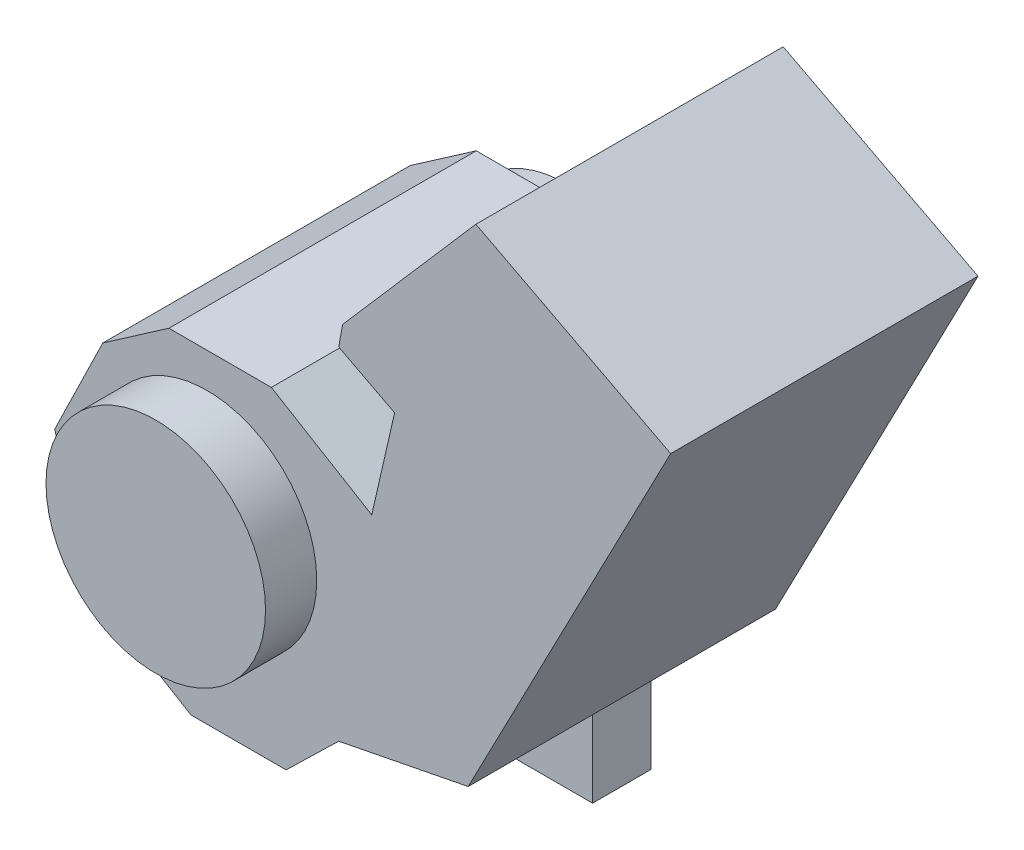
ISO-10303-21;
HEADER;
FILE_DESCRIPTION(('STEP AP214'),'2;1');
FILE_NAME('part.step','',(''),(''),'','','');
FILE_SCHEMA(('AUTOMOTIVE_DESIGN { 1 0 10303 214 1 1 1 1 }'));
ENDSEC;
DATA;
#1=APPLICATION_CONTEXT('core data for automotive mechanical design processes');
#2=APPLICATION_PROTOCOL_DEFINITION('international standard','automotive_design',2000,#1);
#3=PRODUCT_CONTEXT('',#1,'mechanical');
#4=PRODUCT('Part','Part','',(#3));
#5=PRODUCT_RELATED_PRODUCT_CATEGORY('part','',(#4));
#6=PRODUCT_DEFINITION_FORMATION('','',#4);
#7=PRODUCT_DEFINITION_CONTEXT('part definition',#1,'design');
#8=PRODUCT_DEFINITION('design','',#6,#7);
#9=PRODUCT_DEFINITION_SHAPE('','',#8);
#10=(LENGTH_UNIT() NAMED_UNIT(*) SI_UNIT(.MILLI.,.METRE.));
#11=(NAMED_UNIT(*) PLANE_ANGLE_UNIT() SI_UNIT($,.RADIAN.));
#12=(NAMED_UNIT(*) SI_UNIT($,.STERADIAN.) SOLID_ANGLE_UNIT());
#13=UNCERTAINTY_MEASURE_WITH_UNIT(LENGTH_MEASURE(1.E-05),#10,'distance_accuracy_value','');
#14=(GEOMETRIC_REPRESENTATION_CONTEXT(3) GLOBAL_UNCERTAINTY_ASSIGNED_CONTEXT((#13)) GLOBAL_UNIT_ASSIGNED_CONTEXT((#10,
#11,#12)) REPRESENTATION_CONTEXT('',''));
#15=CARTESIAN_POINT('',(0.,0.,0.));
#16=DIRECTION('',(0.,0.,1.));
#17=DIRECTION('',(1.,0.,0.));
#18=AXIS2_PLACEMENT_3D('',#15,#16,#17);
#19=CARTESIAN_POINT('',(-2.85466770870251,14.4994895672538,-105.));
#20=DIRECTION('',(0.193172291046634,-0.981164851577855,0.));
#21=DIRECTION('',(0.981164851577855,0.193172291046634,0.));
#22=AXIS2_PLACEMENT_3D('',#19,#20,#21);
#23=PLANE('',#22);
#24=DIRECTION('',(0.,0.,1.));
#25=VECTOR('',#24,1.);
#26=CARTESIAN_POINT('',(189.435353131504,52.3576576532518,-105.));
#27=LINE('',#26,#25);
#28=CARTESIAN_POINT('',(189.435353131504,52.3576576532518,-105.));
#29=VERTEX_POINT('',#28);
#30=CARTESIAN_POINT('',(189.435353131504,52.3576576532518,-20.));
#31=VERTEX_POINT('',#30);
#32=EDGE_CURVE('E309',#29,#31,#27,.T.);
#33=ORIENTED_EDGE('',*,*,#32,.T.);
#34=DIRECTION('',(0.981164851577855,0.193172291046634,0.));
#35=VECTOR('',#34,1.);
#36=CARTESIAN_POINT('',(-2.85466770870251,14.4994895672538,-20.));
#37=LINE('',#36,#35);
#38=CARTESIAN_POINT('',(100.96354126831,34.9392772830456,-20.));
#39=VERTEX_POINT('',#38);
#40=EDGE_CURVE('E202',#39,#31,#37,.T.);
#41=ORIENTED_EDGE('',*,*,#40,.F.);
#42=DIRECTION('',(0.,0.,1.));
#43=VECTOR('',#42,1.);
#44=CARTESIAN_POINT('',(100.96354126831,34.9392772830456,-105.));
#45=LINE('',#44,#43);
#46=CARTESIAN_POINT('',(100.96354126831,34.9392772830456,-105.));
#47=VERTEX_POINT('',#46);
#48=EDGE_CURVE('E313',#47,#39,#45,.T.);
#49=ORIENTED_EDGE('',*,*,#48,.F.);
#50=DIRECTION('',(0.981164851577855,0.193172291046634,0.));
#51=VECTOR('',#50,1.);
#52=CARTESIAN_POINT('',(-2.85466770870251,14.4994895672538,-105.));
#53=LINE('',#52,#51);
#54=EDGE_CURVE('E269',#47,#29,#53,.T.);
#55=ORIENTED_EDGE('',*,*,#54,.T.);
#56=EDGE_LOOP('',(#33,#41,#49,#55));
#57=FACE_BOUND('',#56,.T.);
#58=ADVANCED_FACE('F35',(#57),#23,.T.);
#59=CARTESIAN_POINT('',(31.5612042021977,-32.4864381311653,-105.));
#60=DIRECTION('',(0.696819192994939,-0.71724682799848,0.));
#61=DIRECTION('',(0.71724682799848,0.696819192994939,0.));
#62=AXIS2_PLACEMENT_3D('',#59,#60,#61);
#63=PLANE('',#62);
#64=ORIENTED_EDGE('',*,*,#48,.T.);
#65=DIRECTION('',(0.71724682799848,0.696819192994939,0.));
#66=VECTOR('',#65,1.);
#67=CARTESIAN_POINT('',(31.5612042021977,-32.4864381311653,-20.));
#68=LINE('',#67,#66);
#69=CARTESIAN_POINT('',(65.,0.,-20.));
#70=VERTEX_POINT('',#69);
#71=EDGE_CURVE('E180',#70,#39,#68,.T.);
#72=ORIENTED_EDGE('',*,*,#71,.F.);
#73=DIRECTION('',(0.,0.,1.));
#74=VECTOR('',#73,1.);
#75=CARTESIAN_POINT('',(65.,0.,-105.));
#76=LINE('',#75,#74);
#77=CARTESIAN_POINT('',(65.,0.,-105.));
#78=VERTEX_POINT('',#77);
#79=EDGE_CURVE('E317',#78,#70,#76,.T.);
#80=ORIENTED_EDGE('',*,*,#79,.F.);
#81=DIRECTION('',(0.71724682799848,0.696819192994939,0.));
#82=VECTOR('',#81,1.);
#83=CARTESIAN_POINT('',(31.5612042021977,-32.4864381311653,-105.));
#84=LINE('',#83,#82);
#85=EDGE_CURVE('E266',#78,#47,#84,.T.);
#86=ORIENTED_EDGE('',*,*,#85,.T.);
#87=EDGE_LOOP('',(#64,#72,#80,#86));
#88=FACE_BOUND('',#87,.T.);
#89=ADVANCED_FACE('F370',(#88),#63,.T.);
#90=CARTESIAN_POINT('',(-108.51999738063,156.513949765839,-105.));
#91=DIRECTION('',(0.569792596014067,-0.821788535772768,0.));
#92=DIRECTION('',(0.821788535772768,0.569792596014067,0.));
#93=AXIS2_PLACEMENT_3D('',#90,#91,#92);
#94=PLANE('',#93);
#95=DIRECTION('',(0.,0.,1.));
#96=VECTOR('',#95,1.);
#97=CARTESIAN_POINT('',(-60.2666413594755,189.970737974536,-105.));
#98=LINE('',#97,#96);
#99=CARTESIAN_POINT('',(-60.2666413594755,189.970737974536,-105.));
#100=VERTEX_POINT('',#99);
#101=CARTESIAN_POINT('',(-60.2666413594755,189.970737974536,105.));
#102=VERTEX_POINT('',#101);
#103=EDGE_CURVE('E39',#100,#102,#98,.T.);
#104=ORIENTED_EDGE('',*,*,#103,.T.);
#105=DIRECTION('',(0.821788535772768,0.569792596014067,0.));
#106=VECTOR('',#105,1.);
#107=CARTESIAN_POINT('',(-108.51999738063,156.513949765839,105.));
#108=LINE('',#107,#106);
#109=CARTESIAN_POINT('',(-15.0682718919732,221.30933075531,105.));
#110=VERTEX_POINT('',#109);
#111=EDGE_CURVE('E209',#102,#110,#108,.T.);
#112=ORIENTED_EDGE('',*,*,#111,.T.);
#113=DIRECTION('',(0.,0.,1.));
#114=VECTOR('',#113,1.);
#115=CARTESIAN_POINT('',(-15.0682718919732,221.30933075531,-105.));
#116=LINE('',#115,#114);
#117=CARTESIAN_POINT('',(-15.0682718919732,221.30933075531,-105.));
#118=VERTEX_POINT('',#117);
#119=EDGE_CURVE('E11',#118,#110,#116,.T.);
#120=ORIENTED_EDGE('',*,*,#119,.F.);
#121=DIRECTION('',(0.821788535772768,0.569792596014067,0.));
#122=VECTOR('',#121,1.);
#123=CARTESIAN_POINT('',(-108.51999738063,156.513949765839,-105.));
#124=LINE('',#123,#122);
#125=EDGE_CURVE('E60',#100,#118,#124,.T.);
#126=ORIENTED_EDGE('',*,*,#125,.F.);
#127=EDGE_LOOP('',(#104,#112,#120,#126));
#128=FACE_BOUND('',#127,.T.);
#129=ADVANCED_FACE('F37',(#128),#94,.F.);
#130=CARTESIAN_POINT('',(0.,221.30933075531,-105.));
#131=DIRECTION('',(0.,1.,0.));
#132=DIRECTION('',(0.,0.,1.));
#133=AXIS2_PLACEMENT_3D('',#130,#131,#132);
#134=PLANE('',#133);
#135=ORIENTED_EDGE('',*,*,#119,.T.);
#136=DIRECTION('',(-1.,0.,0.));
#137=VECTOR('',#136,1.);
#138=CARTESIAN_POINT('',(0.,221.30933075531,105.));
#139=LINE('',#138,#137);
#140=CARTESIAN_POINT('',(54.9317281080268,221.30933075531,105.));
#141=VERTEX_POINT('',#140);
#142=EDGE_CURVE('E251',#141,#110,#139,.T.);
#143=ORIENTED_EDGE('',*,*,#142,.F.);
#144=DIRECTION('',(0.,0.,1.));
#145=VECTOR('',#144,1.);
#146=CARTESIAN_POINT('',(54.9317281080268,221.30933075531,-105.));
#147=LINE('',#146,#145);
#148=CARTESIAN_POINT('',(54.9317281080268,221.30933075531,-105.));
#149=VERTEX_POINT('',#148);
#150=EDGE_CURVE('E44',#149,#141,#147,.T.);
#151=ORIENTED_EDGE('',*,*,#150,.F.);
#152=DIRECTION('',(-1.,0.,0.));
#153=VECTOR('',#152,1.);
#154=CARTESIAN_POINT('',(0.,221.30933075531,-105.));
#155=LINE('',#154,#153);
#156=EDGE_CURVE('E293',#149,#118,#155,.T.);
#157=ORIENTED_EDGE('',*,*,#156,.T.);
#158=EDGE_LOOP('',(#135,#143,#151,#157));
#159=FACE_BOUND('',#158,.T.);
#160=ADVANCED_FACE('F335',(#159),#134,.T.);
#161=CARTESIAN_POINT('',(112.187588071785,186.95052462002,-105.));
#162=DIRECTION('',(0.514554007811645,0.857457971591012,0.));
#163=DIRECTION('',(-0.857457971591013,0.514554007811645,0.));
#164=AXIS2_PLACEMENT_3D('',#161,#162,#163);
#165=PLANE('',#164);
#166=ORIENTED_EDGE('',*,*,#150,.T.);
#167=DIRECTION('',(-0.857457971591012,0.514554007811645,0.));
#168=VECTOR('',#167,1.);
#169=CARTESIAN_POINT('',(112.187588071785,186.95052462002,105.));
#170=LINE('',#169,#168);
#171=CARTESIAN_POINT('',(123.528365835308,180.145010130378,105.));
#172=VERTEX_POINT('',#171);
#173=EDGE_CURVE('E248',#172,#141,#170,.T.);
#174=ORIENTED_EDGE('',*,*,#173,.F.);
#175=DIRECTION('',(0.,0.,1.));
#176=VECTOR('',#175,1.);
#177=CARTESIAN_POINT('',(123.528365835308,180.145010130378,-105.));
#178=LINE('',#177,#176);
#179=CARTESIAN_POINT('',(123.528365835308,180.145010130378,-105.));
#180=VERTEX_POINT('',#179);
#181=EDGE_CURVE('E297',#180,#172,#178,.T.);
#182=ORIENTED_EDGE('',*,*,#181,.F.);
#183=DIRECTION('',(-0.857457971591012,0.514554007811645,0.));
#184=VECTOR('',#183,1.);
#185=CARTESIAN_POINT('',(112.187588071785,186.95052462002,-105.));
#186=LINE('',#185,#184);
#187=EDGE_CURVE('E290',#180,#149,#186,.T.);
#188=ORIENTED_EDGE('',*,*,#187,.T.);
#189=EDGE_LOOP('',(#166,#174,#182,#188));
#190=FACE_BOUND('',#189,.T.);
#191=ADVANCED_FACE('F424',(#190),#165,.T.);
#192=CARTESIAN_POINT('',(78.14455306862,-17.9069093336734,-105.));
#193=DIRECTION('',(-0.974735624762223,0.223361728636307,0.));
#194=DIRECTION('',(-0.223361728636307,-0.974735624762223,0.));
#195=AXIS2_PLACEMENT_3D('',#192,#193,#194);
#196=PLANE('',#195);
#197=ORIENTED_EDGE('',*,*,#181,.T.);
#198=DIRECTION('',(-0.223361728636307,-0.974735624762223,0.));
#199=VECTOR('',#198,1.);
#200=CARTESIAN_POINT('',(78.14455306862,-17.9069093336734,105.));
#201=LINE('',#200,#199);
#202=CARTESIAN_POINT('',(139.163686839849,248.376503863734,105.));
#203=VERTEX_POINT('',#202);
#204=EDGE_CURVE('E245',#203,#172,#201,.T.);
#205=ORIENTED_EDGE('',*,*,#204,.F.);
#206=DIRECTION('',(0.,0.,1.));
#207=VECTOR('',#206,1.);
#208=CARTESIAN_POINT('',(139.163686839849,248.376503863734,-105.));
#209=LINE('',#208,#207);
#210=CARTESIAN_POINT('',(139.163686839849,248.376503863734,-105.));
#211=VERTEX_POINT('',#210);
#212=EDGE_CURVE('E299',#211,#203,#209,.T.);
#213=ORIENTED_EDGE('',*,*,#212,.F.);
#214=DIRECTION('',(-0.223361728636307,-0.974735624762223,0.));
#215=VECTOR('',#214,1.);
#216=CARTESIAN_POINT('',(78.14455306862,-17.9069093336734,-105.));
#217=LINE('',#216,#215);
#218=EDGE_CURVE('E287',#211,#180,#217,.T.);
#219=ORIENTED_EDGE('',*,*,#218,.T.);
#220=EDGE_LOOP('',(#197,#205,#213,#219));
#221=FACE_BOUND('',#220,.T.);
#222=ADVANCED_FACE('F342',(#221),#196,.T.);
#223=CARTESIAN_POINT('',(131.221591851007,252.503863861829,-105.));
#224=DIRECTION('',(-0.461130274581587,-0.88733244607887,0.));
#225=DIRECTION('',(0.88733244607887,-0.461130274581587,0.));
#226=AXIS2_PLACEMENT_3D('',#223,#224,#225);
#227=PLANE('',#226);
#228=ORIENTED_EDGE('',*,*,#212,.T.);
#229=DIRECTION('',(0.88733244607887,-0.461130274581587,0.));
#230=VECTOR('',#229,1.);
#231=CARTESIAN_POINT('',(131.221591851007,252.503863861829,105.));
#232=LINE('',#231,#230);
#233=CARTESIAN_POINT('',(100.96354126831,268.22841358968,105.));
#234=VERTEX_POINT('',#233);
#235=EDGE_CURVE('E242',#234,#203,#232,.T.);
#236=ORIENTED_EDGE('',*,*,#235,.F.);
#237=DIRECTION('',(0.,0.,1.));
#238=VECTOR('',#237,1.);
#239=CARTESIAN_POINT('',(100.96354126831,268.22841358968,-105.));
#240=LINE('',#239,#238);
#241=CARTESIAN_POINT('',(100.96354126831,268.22841358968,-105.));
#242=VERTEX_POINT('',#241);
#243=EDGE_CURVE('E301',#242,#234,#240,.T.);
#244=ORIENTED_EDGE('',*,*,#243,.F.);
#245=DIRECTION('',(0.88733244607887,-0.461130274581587,0.));
#246=VECTOR('',#245,1.);
#247=CARTESIAN_POINT('',(131.221591851007,252.503863861829,-105.));
#248=LINE('',#247,#246);
#249=EDGE_CURVE('E284',#242,#211,#248,.T.);
#250=ORIENTED_EDGE('',*,*,#249,.T.);
#251=EDGE_LOOP('',(#228,#236,#244,#250));
#252=FACE_BOUND('',#251,.T.);
#253=ADVANCED_FACE('F346',(#252),#227,.T.);
#254=CARTESIAN_POINT('',(50.2608933289447,-9.18611017544648,-105.));
#255=DIRECTION('',(-0.983704956146424,0.179790320242673,0.));
#256=DIRECTION('',(-0.179790320242673,-0.983704956146424,0.));
#257=AXIS2_PLACEMENT_3D('',#254,#255,#256);
#258=PLANE('',#257);
#259=ORIENTED_EDGE('',*,*,#243,.T.);
#260=DIRECTION('',(-0.179790320242673,-0.983704956146424,0.));
#261=VECTOR('',#260,1.);
#262=CARTESIAN_POINT('',(50.2608933289447,-9.18611017544648,105.));
#263=LINE('',#262,#261);
#264=CARTESIAN_POINT('',(103.646308232307,282.906907710544,105.));
#265=VERTEX_POINT('',#264);
#266=EDGE_CURVE('E239',#265,#234,#263,.T.);
#267=ORIENTED_EDGE('',*,*,#266,.F.);
#268=DIRECTION('',(0.,0.,1.));
#269=VECTOR('',#268,1.);
#270=CARTESIAN_POINT('',(103.646308232307,282.906907710544,-105.));
#271=LINE('',#270,#269);
#272=CARTESIAN_POINT('',(103.646308232307,282.906907710544,-105.));
#273=VERTEX_POINT('',#272);
#274=EDGE_CURVE('E303',#273,#265,#271,.T.);
#275=ORIENTED_EDGE('',*,*,#274,.F.);
#276=DIRECTION('',(-0.179790320242673,-0.983704956146424,0.));
#277=VECTOR('',#276,1.);
#278=CARTESIAN_POINT('',(50.2608933289447,-9.18611017544648,-105.));
#279=LINE('',#278,#277);
#280=EDGE_CURVE('E281',#273,#242,#279,.T.);
#281=ORIENTED_EDGE('',*,*,#280,.T.);
#282=EDGE_LOOP('',(#259,#267,#275,#281));
#283=FACE_BOUND('',#282,.T.);
#284=ADVANCED_FACE('F350',(#283),#258,.T.);
#285=CARTESIAN_POINT('',(-80.9714438656838,70.3175722133441,-105.));
#286=DIRECTION('',(-0.755031891842862,0.655688067834232,0.));
#287=DIRECTION('',(-0.655688067834233,-0.755031891842862,0.));
#288=AXIS2_PLACEMENT_3D('',#285,#286,#287);
#289=PLANE('',#288);
#290=ORIENTED_EDGE('',*,*,#274,.T.);
#291=DIRECTION('',(-0.655688067834233,-0.755031891842862,0.));
#292=VECTOR('',#291,1.);
#293=CARTESIAN_POINT('',(-80.9714438656838,70.3175722133441,105.));
#294=LINE('',#293,#292);
#295=CARTESIAN_POINT('',(194.674568594149,387.726932664151,105.));
#296=VERTEX_POINT('',#295);
#297=EDGE_CURVE('E236',#296,#265,#294,.T.);
#298=ORIENTED_EDGE('',*,*,#297,.F.);
#299=DIRECTION('',(0.,0.,1.));
#300=VECTOR('',#299,1.);
#301=CARTESIAN_POINT('',(194.674568594149,387.726932664151,-105.));
#302=LINE('',#301,#300);
#303=CARTESIAN_POINT('',(194.674568594149,387.726932664151,-105.));
#304=VERTEX_POINT('',#303);
#305=EDGE_CURVE('E305',#304,#296,#302,.T.);
#306=ORIENTED_EDGE('',*,*,#305,.F.);
#307=DIRECTION('',(-0.655688067834233,-0.755031891842862,0.));
#308=VECTOR('',#307,1.);
#309=CARTESIAN_POINT('',(-80.9714438656838,70.3175722133441,-105.));
#310=LINE('',#309,#308);
#311=EDGE_CURVE('E278',#304,#273,#310,.T.);
#312=ORIENTED_EDGE('',*,*,#311,.T.);
#313=EDGE_LOOP('',(#290,#298,#306,#312));
#314=FACE_BOUND('',#313,.T.);
#315=ADVANCED_FACE('F354',(#314),#289,.T.);
#316=CARTESIAN_POINT('',(200.044319262188,384.936372473402,-105.));
#317=DIRECTION('',(0.461130274581587,0.88733244607887,0.));
#318=DIRECTION('',(-0.88733244607887,0.461130274581587,0.));
#319=AXIS2_PLACEMENT_3D('',#316,#317,#318);
#320=PLANE('',#319);
#321=ORIENTED_EDGE('',*,*,#305,.T.);
#322=DIRECTION('',(-0.88733244607887,0.461130274581587,0.));
#323=VECTOR('',#322,1.);
#324=CARTESIAN_POINT('',(200.044319262188,384.936372473402,105.));
#325=LINE('',#324,#323);
#326=CARTESIAN_POINT('',(327.77443550598,318.557391476913,105.));
#327=VERTEX_POINT('',#326);
#328=EDGE_CURVE('E233',#327,#296,#325,.T.);
#329=ORIENTED_EDGE('',*,*,#328,.F.);
#330=DIRECTION('',(0.,0.,1.));
#331=VECTOR('',#330,1.);
#332=CARTESIAN_POINT('',(327.77443550598,318.557391476913,-105.));
#333=LINE('',#332,#331);
#334=CARTESIAN_POINT('',(327.77443550598,318.557391476913,-105.));
#335=VERTEX_POINT('',#334);
#336=EDGE_CURVE('E307',#335,#327,#333,.T.);
#337=ORIENTED_EDGE('',*,*,#336,.F.);
#338=DIRECTION('',(-0.88733244607887,0.461130274581587,0.));
#339=VECTOR('',#338,1.);
#340=CARTESIAN_POINT('',(200.044319262188,384.936372473402,-105.));
#341=LINE('',#340,#339);
#342=EDGE_CURVE('E275',#335,#304,#341,.T.);
#343=ORIENTED_EDGE('',*,*,#342,.T.);
#344=EDGE_LOOP('',(#321,#329,#337,#343));
#345=FACE_BOUND('',#344,.T.);
#346=ADVANCED_FACE('F358',(#345),#320,.T.);
#347=CARTESIAN_POINT('',(127.730116243792,-66.3789809964893,-105.));
#348=DIRECTION('',(0.88733244607887,-0.461130274581587,0.));
#349=DIRECTION('',(0.461130274581587,0.88733244607887,0.));
#350=AXIS2_PLACEMENT_3D('',#347,#348,#349);
#351=PLANE('',#350);
#352=ORIENTED_EDGE('',*,*,#336,.T.);
#353=DIRECTION('',(0.461130274581587,0.88733244607887,0.));
#354=VECTOR('',#353,1.);
#355=CARTESIAN_POINT('',(127.730116243792,-66.3789809964893,105.));
#356=LINE('',#355,#354);
#357=CARTESIAN_POINT('',(189.435353131504,52.3576576532518,105.));
#358=VERTEX_POINT('',#357);
#359=EDGE_CURVE('E230',#358,#327,#356,.T.);
#360=ORIENTED_EDGE('',*,*,#359,.F.);
#361=CARTESIAN_POINT('',(189.435353131504,52.3576576532518,20.));
#362=VERTEX_POINT('',#361);
#363=EDGE_CURVE('E312',#362,#358,#27,.T.);
#364=ORIENTED_EDGE('',*,*,#363,.F.);
#365=DIRECTION('',(0.,0.,1.));
#366=VECTOR('',#365,1.);
#367=CARTESIAN_POINT('',(189.435353131504,52.3576576532518,-20.));
#368=LINE('',#367,#366);
#369=EDGE_CURVE('E179',#31,#362,#368,.T.);
#370=ORIENTED_EDGE('',*,*,#369,.F.);
#371=ORIENTED_EDGE('',*,*,#32,.F.);
#372=DIRECTION('',(0.461130274581587,0.88733244607887,0.));
#373=VECTOR('',#372,1.);
#374=CARTESIAN_POINT('',(127.730116243792,-66.3789809964893,-105.));
#375=LINE('',#374,#373);
#376=EDGE_CURVE('E272',#29,#335,#375,.T.);
#377=ORIENTED_EDGE('',*,*,#376,.T.);
#378=EDGE_LOOP('',(#352,#360,#364,#370,#371,#377));
#379=FACE_BOUND('',#378,.T.);
#380=ADVANCED_FACE('F362',(#379),#351,.T.);
#381=DIRECTION('',(0.981164851577855,0.193172291046634,0.));
#382=VECTOR('',#381,1.);
#383=CARTESIAN_POINT('',(-2.85466770870251,14.4994895672538,20.));
#384=LINE('',#383,#382);
#385=CARTESIAN_POINT('',(100.96354126831,34.9392772830456,20.));
#386=VERTEX_POINT('',#385);
#387=EDGE_CURVE('E187',#386,#362,#384,.T.);
#388=ORIENTED_EDGE('',*,*,#387,.T.);
#389=ORIENTED_EDGE('',*,*,#363,.T.);
#390=DIRECTION('',(0.981164851577855,0.193172291046634,0.));
#391=VECTOR('',#390,1.);
#392=CARTESIAN_POINT('',(-2.85466770870251,14.4994895672538,105.));
#393=LINE('',#392,#391);
#394=CARTESIAN_POINT('',(100.96354126831,34.9392772830456,105.));
#395=VERTEX_POINT('',#394);
#396=EDGE_CURVE('E227',#395,#358,#393,.T.);
#397=ORIENTED_EDGE('',*,*,#396,.F.);
#398=EDGE_CURVE('E316',#386,#395,#45,.T.);
#399=ORIENTED_EDGE('',*,*,#398,.F.);
#400=EDGE_LOOP('',(#388,#389,#397,#399));
#401=FACE_BOUND('',#400,.T.);
#402=ADVANCED_FACE('F387',(#401),#23,.T.);
#403=DIRECTION('',(0.71724682799848,0.696819192994939,0.));
#404=VECTOR('',#403,1.);
#405=CARTESIAN_POINT('',(31.5612042021977,-32.4864381311653,20.));
#406=LINE('',#405,#404);
#407=CARTESIAN_POINT('',(65.,0.,20.));
#408=VERTEX_POINT('',#407);
#409=EDGE_CURVE('E52',#408,#386,#406,.T.);
#410=ORIENTED_EDGE('',*,*,#409,.T.);
#411=ORIENTED_EDGE('',*,*,#398,.T.);
#412=DIRECTION('',(0.71724682799848,0.696819192994939,0.));
#413=VECTOR('',#412,1.);
#414=CARTESIAN_POINT('',(31.5612042021977,-32.4864381311653,105.));
#415=LINE('',#414,#413);
#416=CARTESIAN_POINT('',(65.,0.,105.));
#417=VERTEX_POINT('',#416);
#418=EDGE_CURVE('E224',#417,#395,#415,.T.);
#419=ORIENTED_EDGE('',*,*,#418,.F.);
#420=EDGE_CURVE('E319',#408,#417,#76,.T.);
#421=ORIENTED_EDGE('',*,*,#420,.F.);
#422=EDGE_LOOP('',(#410,#411,#419,#421));
#423=FACE_BOUND('',#422,.T.);
#424=ADVANCED_FACE('F384',(#423),#63,.T.);
#425=CARTESIAN_POINT('',(0.,0.,-105.));
#426=DIRECTION('',(0.,-1.,0.));
#427=DIRECTION('',(0.,0.,-1.));
#428=AXIS2_PLACEMENT_3D('',#425,#426,#427);
#429=PLANE('',#428);
#430=ORIENTED_EDGE('',*,*,#79,.T.);
#431=DIRECTION('',(-1.,0.,0.));
#432=VECTOR('',#431,1.);
#433=CARTESIAN_POINT('',(0.,0.,-20.));
#434=LINE('',#433,#432);
#435=CARTESIAN_POINT('',(189.435353131504,0.,-20.));
#436=VERTEX_POINT('',#435);
#437=EDGE_CURVE('E175',#436,#70,#434,.T.);
#438=ORIENTED_EDGE('',*,*,#437,.F.);
#439=DIRECTION('',(0.,0.,1.));
#440=VECTOR('',#439,1.);
#441=CARTESIAN_POINT('',(189.435353131504,0.,-20.));
#442=LINE('',#441,#440);
#443=CARTESIAN_POINT('',(189.435353131504,0.,20.));
#444=VERTEX_POINT('',#443);
#445=EDGE_CURVE('E169',#436,#444,#442,.T.);
#446=ORIENTED_EDGE('',*,*,#445,.T.);
#447=DIRECTION('',(-1.,0.,0.));
#448=VECTOR('',#447,1.);
#449=CARTESIAN_POINT('',(0.,0.,20.));
#450=LINE('',#449,#448);
#451=EDGE_CURVE('E173',#444,#408,#450,.T.);
#452=ORIENTED_EDGE('',*,*,#451,.T.);
#453=ORIENTED_EDGE('',*,*,#420,.T.);
#454=DIRECTION('',(1.,0.,0.));
#455=VECTOR('',#454,1.);
#456=CARTESIAN_POINT('',(0.,0.,105.));
#457=LINE('',#456,#455);
#458=CARTESIAN_POINT('',(0.,0.,105.));
#459=VERTEX_POINT('',#458);
#460=EDGE_CURVE('E221',#459,#417,#457,.T.);
#461=ORIENTED_EDGE('',*,*,#460,.F.);
#462=DIRECTION('',(0.,0.,1.));
#463=VECTOR('',#462,1.);
#464=CARTESIAN_POINT('',(0.,0.,-105.));
#465=LINE('',#464,#463);
#466=CARTESIAN_POINT('',(0.,0.,-105.));
#467=VERTEX_POINT('',#466);
#468=EDGE_CURVE('E320',#467,#459,#465,.T.);
#469=ORIENTED_EDGE('',*,*,#468,.F.);
#470=DIRECTION('',(1.,0.,0.));
#471=VECTOR('',#470,1.);
#472=CARTESIAN_POINT('',(0.,0.,-105.));
#473=LINE('',#472,#471);
#474=EDGE_CURVE('E263',#467,#78,#473,.T.);
#475=ORIENTED_EDGE('',*,*,#474,.T.);
#476=EDGE_LOOP('',(#430,#438,#446,#452,#453,#461,#469,#475));
#477=FACE_BOUND('',#476,.T.);
#478=ADVANCED_FACE('F172',(#477),#429,.T.);
#479=CARTESIAN_POINT('',(0.,0.,-105.));
#480=DIRECTION('',(0.514554007811645,0.857457971591012,0.));
#481=DIRECTION('',(-0.857457971591012,0.514554007811645,0.));
#482=AXIS2_PLACEMENT_3D('',#479,#480,#481);
#483=PLANE('',#482);
#484=ORIENTED_EDGE('',*,*,#468,.T.);
#485=DIRECTION('',(-0.857457971591012,0.514554007811645,0.));
#486=VECTOR('',#485,1.);
#487=CARTESIAN_POINT('',(0.,0.,105.));
#488=LINE('',#487,#486);
#489=CARTESIAN_POINT('',(-68.596637727281,41.1643206249316,105.));
#490=VERTEX_POINT('',#489);
#491=EDGE_CURVE('E218',#459,#490,#488,.T.);
#492=ORIENTED_EDGE('',*,*,#491,.T.);
#493=DIRECTION('',(0.,0.,1.));
#494=VECTOR('',#493,1.);
#495=CARTESIAN_POINT('',(-68.596637727281,41.1643206249316,-105.));
#496=LINE('',#495,#494);
#497=CARTESIAN_POINT('',(-68.596637727281,41.1643206249316,-105.));
#498=VERTEX_POINT('',#497);
#499=EDGE_CURVE('E322',#498,#490,#496,.T.);
#500=ORIENTED_EDGE('',*,*,#499,.F.);
#501=DIRECTION('',(-0.857457971591012,0.514554007811645,0.));
#502=VECTOR('',#501,1.);
#503=CARTESIAN_POINT('',(0.,0.,-105.));
#504=LINE('',#503,#502);
#505=EDGE_CURVE('E261',#467,#498,#504,.T.);
#506=ORIENTED_EDGE('',*,*,#505,.F.);
#507=EDGE_LOOP('',(#484,#492,#500,#506));
#508=FACE_BOUND('',#507,.T.);
#509=ADVANCED_FACE('F377',(#508),#483,.F.);
#510=CARTESIAN_POINT('',(-51.5148030496431,-15.523139468496,-105.));
#511=DIRECTION('',(-0.957474140078946,-0.288519100026468,0.));
#512=DIRECTION('',(0.288519100026468,-0.957474140078946,0.));
#513=AXIS2_PLACEMENT_3D('',#510,#511,#512);
#514=PLANE('',#513);
#515=ORIENTED_EDGE('',*,*,#499,.T.);
#516=DIRECTION('',(0.288519100026468,-0.957474140078946,0.));
#517=VECTOR('',#516,1.);
#518=CARTESIAN_POINT('',(-51.5148030496431,-15.523139468496,105.));
#519=LINE('',#518,#517);
#520=CARTESIAN_POINT('',(-93.1207612295307,122.549622531642,105.));
#521=VERTEX_POINT('',#520);
#522=EDGE_CURVE('E215',#521,#490,#519,.T.);
#523=ORIENTED_EDGE('',*,*,#522,.F.);
#524=DIRECTION('',(0.,0.,1.));
#525=VECTOR('',#524,1.);
#526=CARTESIAN_POINT('',(-93.1207612295307,122.549622531642,-105.));
#527=LINE('',#526,#525);
#528=CARTESIAN_POINT('',(-93.1207612295307,122.549622531642,-105.));
#529=VERTEX_POINT('',#528);
#530=EDGE_CURVE('E323',#529,#521,#527,.T.);
#531=ORIENTED_EDGE('',*,*,#530,.F.);
#532=DIRECTION('',(0.288519100026468,-0.957474140078946,0.));
#533=VECTOR('',#532,1.);
#534=CARTESIAN_POINT('',(-51.5148030496431,-15.523139468496,-105.));
#535=LINE('',#534,#533);
#536=EDGE_CURVE('E258',#529,#498,#535,.T.);
#537=ORIENTED_EDGE('',*,*,#536,.T.);
#538=EDGE_LOOP('',(#515,#523,#531,#537));
#539=FACE_BOUND('',#538,.T.);
#540=ADVANCED_FACE('F380',(#539),#514,.T.);
#541=CARTESIAN_POINT('',(-123.510276563682,60.1862102807223,-105.));
#542=DIRECTION('',(-0.898948205905253,0.438054931600736,0.));
#543=DIRECTION('',(-0.438054931600737,-0.898948205905254,0.));
#544=AXIS2_PLACEMENT_3D('',#541,#542,#543);
#545=PLANE('',#544);
#546=ORIENTED_EDGE('',*,*,#530,.T.);
#547=DIRECTION('',(-0.438054931600737,-0.898948205905253,0.));
#548=VECTOR('',#547,1.);
#549=CARTESIAN_POINT('',(-123.510276563682,60.1862102807223,105.));
#550=LINE('',#549,#548);
#551=EDGE_CURVE('E212',#102,#521,#550,.T.);
#552=ORIENTED_EDGE('',*,*,#551,.F.);
#553=ORIENTED_EDGE('',*,*,#103,.F.);
#554=DIRECTION('',(-0.438054931600737,-0.898948205905253,0.));
#555=VECTOR('',#554,1.);
#556=CARTESIAN_POINT('',(-123.510276563682,60.1862102807223,-105.));
#557=LINE('',#556,#555);
#558=EDGE_CURVE('E255',#100,#529,#557,.T.);
#559=ORIENTED_EDGE('',*,*,#558,.T.);
#560=EDGE_LOOP('',(#546,#552,#553,#559));
#561=FACE_BOUND('',#560,.T.);
#562=ADVANCED_FACE('F329',(#561),#545,.T.);
#563=CARTESIAN_POINT('',(0.,0.,-105.));
#564=DIRECTION('',(0.,0.,1.));
#565=DIRECTION('',(1.,0.,0.));
#566=AXIS2_PLACEMENT_3D('',#563,#564,#565);
#567=PLANE('',#566);
#568=CARTESIAN_POINT('',(10.9537324736916,122.549622531642,-105.));
#569=DIRECTION('',(0.,0.,1.));
#570=DIRECTION('',(1.,0.,0.));
#571=AXIS2_PLACEMENT_3D('',#568,#569,#570);
#572=CIRCLE('',#571,75.);
#573=CARTESIAN_POINT('',(85.9537324736917,122.549622531642,-105.));
#574=VERTEX_POINT('',#573);
#575=EDGE_CURVE('E190',#574,#574,#572,.T.);
#576=ORIENTED_EDGE('',*,*,#575,.T.);
#577=EDGE_LOOP('',(#576));
#578=FACE_BOUND('',#577,.T.);
#579=ORIENTED_EDGE('',*,*,#125,.T.);
#580=ORIENTED_EDGE('',*,*,#156,.F.);
#581=ORIENTED_EDGE('',*,*,#187,.F.);
#582=ORIENTED_EDGE('',*,*,#218,.F.);
#583=ORIENTED_EDGE('',*,*,#249,.F.);
#584=ORIENTED_EDGE('',*,*,#280,.F.);
#585=ORIENTED_EDGE('',*,*,#311,.F.);
#586=ORIENTED_EDGE('',*,*,#342,.F.);
#587=ORIENTED_EDGE('',*,*,#376,.F.);
#588=ORIENTED_EDGE('',*,*,#54,.F.);
#589=ORIENTED_EDGE('',*,*,#85,.F.);
#590=ORIENTED_EDGE('',*,*,#474,.F.);
#591=ORIENTED_EDGE('',*,*,#505,.T.);
#592=ORIENTED_EDGE('',*,*,#536,.F.);
#593=ORIENTED_EDGE('',*,*,#558,.F.);
#594=EDGE_LOOP('',(#579,#580,#581,#582,#583,#584,#585,#586,#587,#588,#589,#590,#591,#592,#593));
#595=FACE_BOUND('',#594,.T.);
#596=ADVANCED_FACE('F337',(#578,#595),#567,.F.);
#597=CARTESIAN_POINT('',(0.,0.,105.));
#598=DIRECTION('',(0.,0.,1.));
#599=DIRECTION('',(1.,0.,0.));
#600=AXIS2_PLACEMENT_3D('',#597,#598,#599);
#601=PLANE('',#600);
#602=CARTESIAN_POINT('',(10.9537324736916,122.549622531642,105.));
#603=DIRECTION('',(0.,0.,1.));
#604=DIRECTION('',(1.,0.,0.));
#605=AXIS2_PLACEMENT_3D('',#602,#603,#604);
#606=CIRCLE('',#605,75.);
#607=CARTESIAN_POINT('',(85.9537324736917,122.549622531642,105.));
#608=VERTEX_POINT('',#607);
#609=EDGE_CURVE('E205',#608,#608,#606,.T.);
#610=ORIENTED_EDGE('',*,*,#609,.F.);
#611=EDGE_LOOP('',(#610));
#612=FACE_BOUND('',#611,.T.);
#613=ORIENTED_EDGE('',*,*,#111,.F.);
#614=ORIENTED_EDGE('',*,*,#551,.T.);
#615=ORIENTED_EDGE('',*,*,#522,.T.);
#616=ORIENTED_EDGE('',*,*,#491,.F.);
#617=ORIENTED_EDGE('',*,*,#460,.T.);
#618=ORIENTED_EDGE('',*,*,#418,.T.);
#619=ORIENTED_EDGE('',*,*,#396,.T.);
#620=ORIENTED_EDGE('',*,*,#359,.T.);
#621=ORIENTED_EDGE('',*,*,#328,.T.);
#622=ORIENTED_EDGE('',*,*,#297,.T.);
#623=ORIENTED_EDGE('',*,*,#266,.T.);
#624=ORIENTED_EDGE('',*,*,#235,.T.);
#625=ORIENTED_EDGE('',*,*,#204,.T.);
#626=ORIENTED_EDGE('',*,*,#173,.T.);
#627=ORIENTED_EDGE('',*,*,#142,.T.);
#628=EDGE_LOOP('',(#613,#614,#615,#616,#617,#618,#619,#620,#621,#622,#623,#624,#625,#626,#627));
#629=FACE_BOUND('',#628,.T.);
#630=ADVANCED_FACE('F331',(#612,#629),#601,.T.);
#631=CARTESIAN_POINT('',(189.435353131504,0.,-20.));
#632=DIRECTION('',(1.,0.,0.));
#633=DIRECTION('',(0.,0.,-1.));
#634=AXIS2_PLACEMENT_3D('',#631,#632,#633);
#635=PLANE('',#634);
#636=ORIENTED_EDGE('',*,*,#369,.T.);
#637=DIRECTION('',(0.,1.,0.));
#638=VECTOR('',#637,1.);
#639=CARTESIAN_POINT('',(189.435353131504,0.,20.));
#640=LINE('',#639,#638);
#641=EDGE_CURVE('E183',#444,#362,#640,.T.);
#642=ORIENTED_EDGE('',*,*,#641,.F.);
#643=ORIENTED_EDGE('',*,*,#445,.F.);
#644=DIRECTION('',(0.,1.,0.));
#645=VECTOR('',#644,1.);
#646=CARTESIAN_POINT('',(189.435353131504,0.,-20.));
#647=LINE('',#646,#645);
#648=EDGE_CURVE('E200',#436,#31,#647,.T.);
#649=ORIENTED_EDGE('',*,*,#648,.T.);
#650=EDGE_LOOP('',(#636,#642,#643,#649));
#651=FACE_BOUND('',#650,.T.);
#652=ADVANCED_FACE('F184',(#651),#635,.T.);
#653=CARTESIAN_POINT('',(0.,0.,-20.));
#654=DIRECTION('',(0.,0.,1.));
#655=DIRECTION('',(1.,0.,0.));
#656=AXIS2_PLACEMENT_3D('',#653,#654,#655);
#657=PLANE('',#656);
#658=ORIENTED_EDGE('',*,*,#437,.T.);
#659=ORIENTED_EDGE('',*,*,#71,.T.);
#660=ORIENTED_EDGE('',*,*,#40,.T.);
#661=ORIENTED_EDGE('',*,*,#648,.F.);
#662=EDGE_LOOP('',(#658,#659,#660,#661));
#663=FACE_BOUND('',#662,.T.);
#664=ADVANCED_FACE('F474',(#663),#657,.F.);
#665=CARTESIAN_POINT('',(0.,0.,20.));
#666=DIRECTION('',(0.,0.,1.));
#667=DIRECTION('',(1.,0.,0.));
#668=AXIS2_PLACEMENT_3D('',#665,#666,#667);
#669=PLANE('',#668);
#670=ORIENTED_EDGE('',*,*,#451,.F.);
#671=ORIENTED_EDGE('',*,*,#641,.T.);
#672=ORIENTED_EDGE('',*,*,#387,.F.);
#673=ORIENTED_EDGE('',*,*,#409,.F.);
#674=EDGE_LOOP('',(#670,#671,#672,#673));
#675=FACE_BOUND('',#674,.T.);
#676=ADVANCED_FACE('F189',(#675),#669,.T.);
#677=CARTESIAN_POINT('',(0.,0.,140.));
#678=DIRECTION('',(0.,0.,1.));
#679=DIRECTION('',(1.,0.,0.));
#680=AXIS2_PLACEMENT_3D('',#677,#678,#679);
#681=PLANE('',#680);
#682=CARTESIAN_POINT('',(10.9537324736916,122.549622531642,140.));
#683=DIRECTION('',(0.,0.,1.));
#684=DIRECTION('',(1.,0.,0.));
#685=AXIS2_PLACEMENT_3D('',#682,#683,#684);
#686=CIRCLE('',#685,75.);
#687=CARTESIAN_POINT('',(85.9537324736917,122.549622531642,140.));
#688=VERTEX_POINT('',#687);
#689=EDGE_CURVE('E535',#688,#688,#686,.T.);
#690=ORIENTED_EDGE('',*,*,#689,.T.);
#691=EDGE_LOOP('',(#690));
#692=FACE_BOUND('',#691,.T.);
#693=ADVANCED_FACE('F491',(#692),#681,.T.);
#694=CARTESIAN_POINT('',(10.9537324736916,122.549622531642,-140.));
#695=DIRECTION('',(0.,0.,1.));
#696=DIRECTION('',(1.,0.,0.));
#697=AXIS2_PLACEMENT_3D('',#694,#695,#696);
#698=CYLINDRICAL_SURFACE('',#697,75.);
#699=ORIENTED_EDGE('',*,*,#609,.T.);
#700=EDGE_LOOP('',(#699));
#701=FACE_BOUND('',#700,.T.);
#702=ORIENTED_EDGE('',*,*,#689,.F.);
#703=EDGE_LOOP('',(#702));
#704=FACE_BOUND('',#703,.T.);
#705=ADVANCED_FACE('F500',(#701,#704),#698,.T.);
#706=CARTESIAN_POINT('',(10.9537324736916,122.549622531642,-140.));
#707=DIRECTION('',(0.,0.,1.));
#708=DIRECTION('',(1.,0.,0.));
#709=AXIS2_PLACEMENT_3D('',#706,#707,#708);
#710=CIRCLE('',#709,75.);
#711=CARTESIAN_POINT('',(85.9537324736917,122.549622531642,-140.));
#712=VERTEX_POINT('',#711);
#713=EDGE_CURVE('E193',#712,#712,#710,.T.);
#714=ORIENTED_EDGE('',*,*,#713,.T.);
#715=EDGE_LOOP('',(#714));
#716=FACE_BOUND('',#715,.T.);
#717=ORIENTED_EDGE('',*,*,#575,.F.);
#718=EDGE_LOOP('',(#717));
#719=FACE_BOUND('',#718,.T.);
#720=ADVANCED_FACE('F510',(#716,#719),#698,.T.);
#721=CARTESIAN_POINT('',(0.,0.,-140.));
#722=DIRECTION('',(0.,0.,1.));
#723=DIRECTION('',(1.,0.,0.));
#724=AXIS2_PLACEMENT_3D('',#721,#722,#723);
#725=PLANE('',#724);
#726=ORIENTED_EDGE('',*,*,#713,.F.);
#727=EDGE_LOOP('',(#726));
#728=FACE_BOUND('',#727,.T.);
#729=ADVANCED_FACE('F520',(#728),#725,.F.);
#730=CLOSED_SHELL('',(#58,#89,#129,#160,#191,#222,#253,#284,#315,#346,#380,#402,#424,#478,#509,
#540,#562,#596,#630,#652,#664,#676,#693,#705,#720,#729));
#731=MANIFOLD_SOLID_BREP('B2',#730);
#732=ADVANCED_BREP_SHAPE_REPRESENTATION('',(#18,#731),#14);
#733=SHAPE_DEFINITION_REPRESENTATION(#9,#732);
ENDSEC;
END-ISO-10303-21;
